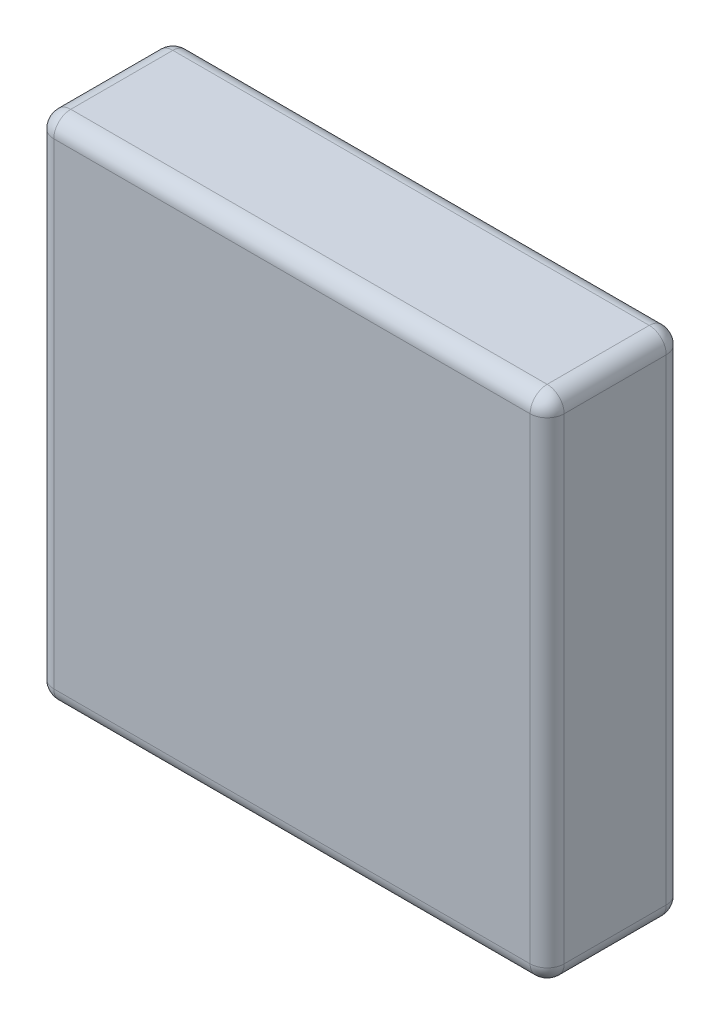
ISO-10303-21;
HEADER;
FILE_DESCRIPTION(('STEP AP214'),'2;1');
FILE_NAME('part.step','',(''),(''),'','','');
FILE_SCHEMA(('AUTOMOTIVE_DESIGN { 1 0 10303 214 1 1 1 1 }'));
ENDSEC;
DATA;
#1=APPLICATION_CONTEXT('core data for automotive mechanical design processes');
#2=APPLICATION_PROTOCOL_DEFINITION('international standard','automotive_design',2000,#1);
#3=PRODUCT_CONTEXT('',#1,'mechanical');
#4=PRODUCT('Part','Part','',(#3));
#5=PRODUCT_RELATED_PRODUCT_CATEGORY('part','',(#4));
#6=PRODUCT_DEFINITION_FORMATION('','',#4);
#7=PRODUCT_DEFINITION_CONTEXT('part definition',#1,'design');
#8=PRODUCT_DEFINITION('design','',#6,#7);
#9=PRODUCT_DEFINITION_SHAPE('','',#8);
#10=(LENGTH_UNIT() NAMED_UNIT(*) SI_UNIT(.MILLI.,.METRE.));
#11=(NAMED_UNIT(*) PLANE_ANGLE_UNIT() SI_UNIT($,.RADIAN.));
#12=(NAMED_UNIT(*) SI_UNIT($,.STERADIAN.) SOLID_ANGLE_UNIT());
#13=UNCERTAINTY_MEASURE_WITH_UNIT(LENGTH_MEASURE(1.E-05),#10,'distance_accuracy_value','');
#14=(GEOMETRIC_REPRESENTATION_CONTEXT(3) GLOBAL_UNCERTAINTY_ASSIGNED_CONTEXT((#13)) GLOBAL_UNIT_ASSIGNED_CONTEXT((#10,
#11,#12)) REPRESENTATION_CONTEXT('',''));
#15=CARTESIAN_POINT('',(0.,0.,0.));
#16=DIRECTION('',(0.,0.,1.));
#17=DIRECTION('',(1.,0.,0.));
#18=AXIS2_PLACEMENT_3D('',#15,#16,#17);
#19=CARTESIAN_POINT('',(0.,0.,8.));
#20=DIRECTION('',(1.,0.,0.));
#21=DIRECTION('',(0.,1.,0.));
#22=AXIS2_PLACEMENT_3D('',#19,#20,#21);
#23=PLANE('',#22);
#24=DIRECTION('',(0.,0.,-1.));
#25=VECTOR('',#24,1.);
#26=CARTESIAN_POINT('',(0.,-29.,8.));
#27=LINE('',#26,#25);
#28=CARTESIAN_POINT('',(0.,-29.,1.));
#29=VERTEX_POINT('',#28);
#30=CARTESIAN_POINT('',(0.,-29.,7.));
#31=VERTEX_POINT('',#30);
#32=EDGE_CURVE('E126',#29,#31,#27,.F.);
#33=ORIENTED_EDGE('',*,*,#32,.T.);
#34=DIRECTION('',(0.,-1.,0.));
#35=VECTOR('',#34,1.);
#36=CARTESIAN_POINT('',(0.,0.,7.));
#37=LINE('',#36,#35);
#38=CARTESIAN_POINT('',(0.,-1.,7.));
#39=VERTEX_POINT('',#38);
#40=EDGE_CURVE('E163',#31,#39,#37,.F.);
#41=ORIENTED_EDGE('',*,*,#40,.T.);
#42=DIRECTION('',(0.,0.,-1.));
#43=VECTOR('',#42,1.);
#44=CARTESIAN_POINT('',(0.,-1.,8.));
#45=LINE('',#44,#43);
#46=CARTESIAN_POINT('',(0.,-1.,1.));
#47=VERTEX_POINT('',#46);
#48=EDGE_CURVE('E160',#39,#47,#45,.T.);
#49=ORIENTED_EDGE('',*,*,#48,.T.);
#50=DIRECTION('',(0.,-1.,0.));
#51=VECTOR('',#50,1.);
#52=CARTESIAN_POINT('',(0.,0.,1.));
#53=LINE('',#52,#51);
#54=EDGE_CURVE('E155',#47,#29,#53,.T.);
#55=ORIENTED_EDGE('',*,*,#54,.T.);
#56=EDGE_LOOP('',(#33,#41,#49,#55));
#57=FACE_BOUND('',#56,.T.);
#58=ADVANCED_FACE('F31',(#57),#23,.F.);
#59=CARTESIAN_POINT('',(0.,-30.,8.));
#60=DIRECTION('',(0.,1.,0.));
#61=DIRECTION('',(0.,0.,1.));
#62=AXIS2_PLACEMENT_3D('',#59,#60,#61);
#63=PLANE('',#62);
#64=DIRECTION('',(0.,0.,-1.));
#65=VECTOR('',#64,1.);
#66=CARTESIAN_POINT('',(29.,-30.,8.));
#67=LINE('',#66,#65);
#68=CARTESIAN_POINT('',(29.,-30.,1.));
#69=VERTEX_POINT('',#68);
#70=CARTESIAN_POINT('',(29.,-30.,7.));
#71=VERTEX_POINT('',#70);
#72=EDGE_CURVE('E148',#69,#71,#67,.F.);
#73=ORIENTED_EDGE('',*,*,#72,.T.);
#74=DIRECTION('',(1.,0.,0.));
#75=VECTOR('',#74,1.);
#76=CARTESIAN_POINT('',(0.,-30.,7.));
#77=LINE('',#76,#75);
#78=CARTESIAN_POINT('',(1.,-30.,7.));
#79=VERTEX_POINT('',#78);
#80=EDGE_CURVE('E152',#71,#79,#77,.F.);
#81=ORIENTED_EDGE('',*,*,#80,.T.);
#82=DIRECTION('',(0.,0.,-1.));
#83=VECTOR('',#82,1.);
#84=CARTESIAN_POINT('',(1.,-30.,8.));
#85=LINE('',#84,#83);
#86=CARTESIAN_POINT('',(1.,-30.,1.));
#87=VERTEX_POINT('',#86);
#88=EDGE_CURVE('E124',#79,#87,#85,.T.);
#89=ORIENTED_EDGE('',*,*,#88,.T.);
#90=DIRECTION('',(1.,0.,0.));
#91=VECTOR('',#90,1.);
#92=CARTESIAN_POINT('',(0.,-30.,1.));
#93=LINE('',#92,#91);
#94=EDGE_CURVE('E142',#87,#69,#93,.T.);
#95=ORIENTED_EDGE('',*,*,#94,.T.);
#96=EDGE_LOOP('',(#73,#81,#89,#95));
#97=FACE_BOUND('',#96,.T.);
#98=ADVANCED_FACE('F150',(#97),#63,.F.);
#99=CARTESIAN_POINT('',(30.,0.,8.));
#100=DIRECTION('',(-1.,0.,0.));
#101=DIRECTION('',(0.,-1.,0.));
#102=AXIS2_PLACEMENT_3D('',#99,#100,#101);
#103=PLANE('',#102);
#104=DIRECTION('',(0.,0.,-1.));
#105=VECTOR('',#104,1.);
#106=CARTESIAN_POINT('',(30.,-1.,8.));
#107=LINE('',#106,#105);
#108=CARTESIAN_POINT('',(30.,-1.,1.));
#109=VERTEX_POINT('',#108);
#110=CARTESIAN_POINT('',(30.,-1.,7.));
#111=VERTEX_POINT('',#110);
#112=EDGE_CURVE('E167',#109,#111,#107,.F.);
#113=ORIENTED_EDGE('',*,*,#112,.T.);
#114=DIRECTION('',(0.,1.,0.));
#115=VECTOR('',#114,1.);
#116=CARTESIAN_POINT('',(30.,-30.,7.));
#117=LINE('',#116,#115);
#118=CARTESIAN_POINT('',(30.,-29.,7.));
#119=VERTEX_POINT('',#118);
#120=EDGE_CURVE('E172',#111,#119,#117,.F.);
#121=ORIENTED_EDGE('',*,*,#120,.T.);
#122=DIRECTION('',(0.,0.,-1.));
#123=VECTOR('',#122,1.);
#124=CARTESIAN_POINT('',(30.,-29.,8.));
#125=LINE('',#124,#123);
#126=CARTESIAN_POINT('',(30.,-29.,1.));
#127=VERTEX_POINT('',#126);
#128=EDGE_CURVE('E169',#119,#127,#125,.T.);
#129=ORIENTED_EDGE('',*,*,#128,.T.);
#130=DIRECTION('',(0.,1.,0.));
#131=VECTOR('',#130,1.);
#132=CARTESIAN_POINT('',(30.,0.,1.));
#133=LINE('',#132,#131);
#134=EDGE_CURVE('E165',#127,#109,#133,.T.);
#135=ORIENTED_EDGE('',*,*,#134,.T.);
#136=EDGE_LOOP('',(#113,#121,#129,#135));
#137=FACE_BOUND('',#136,.T.);
#138=ADVANCED_FACE('F277',(#137),#103,.F.);
#139=CARTESIAN_POINT('',(0.,0.,8.));
#140=DIRECTION('',(0.,-1.,0.));
#141=DIRECTION('',(0.,0.,-1.));
#142=AXIS2_PLACEMENT_3D('',#139,#140,#141);
#143=PLANE('',#142);
#144=DIRECTION('',(0.,0.,-1.));
#145=VECTOR('',#144,1.);
#146=CARTESIAN_POINT('',(1.,0.,8.));
#147=LINE('',#146,#145);
#148=CARTESIAN_POINT('',(1.,0.,1.));
#149=VERTEX_POINT('',#148);
#150=CARTESIAN_POINT('',(1.,0.,7.));
#151=VERTEX_POINT('',#150);
#152=EDGE_CURVE('E176',#149,#151,#147,.F.);
#153=ORIENTED_EDGE('',*,*,#152,.T.);
#154=DIRECTION('',(-1.,0.,0.));
#155=VECTOR('',#154,1.);
#156=CARTESIAN_POINT('',(30.,0.,7.));
#157=LINE('',#156,#155);
#158=CARTESIAN_POINT('',(29.,0.,7.));
#159=VERTEX_POINT('',#158);
#160=EDGE_CURVE('E181',#151,#159,#157,.F.);
#161=ORIENTED_EDGE('',*,*,#160,.T.);
#162=DIRECTION('',(0.,0.,-1.));
#163=VECTOR('',#162,1.);
#164=CARTESIAN_POINT('',(29.,0.,8.));
#165=LINE('',#164,#163);
#166=CARTESIAN_POINT('',(29.,0.,1.));
#167=VERTEX_POINT('',#166);
#168=EDGE_CURVE('E178',#159,#167,#165,.T.);
#169=ORIENTED_EDGE('',*,*,#168,.T.);
#170=DIRECTION('',(-1.,0.,0.));
#171=VECTOR('',#170,1.);
#172=CARTESIAN_POINT('',(0.,0.,1.));
#173=LINE('',#172,#171);
#174=EDGE_CURVE('E174',#167,#149,#173,.T.);
#175=ORIENTED_EDGE('',*,*,#174,.T.);
#176=EDGE_LOOP('',(#153,#161,#169,#175));
#177=FACE_BOUND('',#176,.T.);
#178=ADVANCED_FACE('F287',(#177),#143,.F.);
#179=CARTESIAN_POINT('',(0.,-30.,8.));
#180=DIRECTION('',(0.,0.,1.));
#181=DIRECTION('',(1.,0.,0.));
#182=AXIS2_PLACEMENT_3D('',#179,#180,#181);
#183=PLANE('',#182);
#184=DIRECTION('',(0.,1.,0.));
#185=VECTOR('',#184,1.);
#186=CARTESIAN_POINT('',(29.,0.,8.));
#187=LINE('',#186,#185);
#188=CARTESIAN_POINT('',(29.,-29.,8.));
#189=VERTEX_POINT('',#188);
#190=CARTESIAN_POINT('',(29.,-1.,8.));
#191=VERTEX_POINT('',#190);
#192=EDGE_CURVE('E187',#189,#191,#187,.T.);
#193=ORIENTED_EDGE('',*,*,#192,.T.);
#194=DIRECTION('',(-1.,0.,0.));
#195=VECTOR('',#194,1.);
#196=CARTESIAN_POINT('',(0.,-1.,8.));
#197=LINE('',#196,#195);
#198=CARTESIAN_POINT('',(1.,-1.,8.));
#199=VERTEX_POINT('',#198);
#200=EDGE_CURVE('E189',#191,#199,#197,.T.);
#201=ORIENTED_EDGE('',*,*,#200,.T.);
#202=DIRECTION('',(0.,-1.,0.));
#203=VECTOR('',#202,1.);
#204=CARTESIAN_POINT('',(1.,-30.,8.));
#205=LINE('',#204,#203);
#206=CARTESIAN_POINT('',(1.,-29.,8.));
#207=VERTEX_POINT('',#206);
#208=EDGE_CURVE('E183',#199,#207,#205,.T.);
#209=ORIENTED_EDGE('',*,*,#208,.T.);
#210=DIRECTION('',(1.,0.,0.));
#211=VECTOR('',#210,1.);
#212=CARTESIAN_POINT('',(30.,-29.,8.));
#213=LINE('',#212,#211);
#214=EDGE_CURVE('E185',#207,#189,#213,.T.);
#215=ORIENTED_EDGE('',*,*,#214,.T.);
#216=EDGE_LOOP('',(#193,#201,#209,#215));
#217=FACE_BOUND('',#216,.T.);
#218=ADVANCED_FACE('F269',(#217),#183,.T.);
#219=CARTESIAN_POINT('',(0.,-30.,0.));
#220=DIRECTION('',(0.,0.,1.));
#221=DIRECTION('',(1.,0.,0.));
#222=AXIS2_PLACEMENT_3D('',#219,#220,#221);
#223=PLANE('',#222);
#224=DIRECTION('',(0.,-1.,0.));
#225=VECTOR('',#224,1.);
#226=CARTESIAN_POINT('',(1.,-30.,0.));
#227=LINE('',#226,#225);
#228=CARTESIAN_POINT('',(1.,-29.,0.));
#229=VERTEX_POINT('',#228);
#230=CARTESIAN_POINT('',(1.,-1.,0.));
#231=VERTEX_POINT('',#230);
#232=EDGE_CURVE('E192',#229,#231,#227,.F.);
#233=ORIENTED_EDGE('',*,*,#232,.T.);
#234=DIRECTION('',(-1.,0.,0.));
#235=VECTOR('',#234,1.);
#236=CARTESIAN_POINT('',(0.,-1.,0.));
#237=LINE('',#236,#235);
#238=CARTESIAN_POINT('',(29.,-1.,0.));
#239=VERTEX_POINT('',#238);
#240=EDGE_CURVE('E11',#231,#239,#237,.F.);
#241=ORIENTED_EDGE('',*,*,#240,.T.);
#242=DIRECTION('',(0.,1.,0.));
#243=VECTOR('',#242,1.);
#244=CARTESIAN_POINT('',(29.,-30.,0.));
#245=LINE('',#244,#243);
#246=CARTESIAN_POINT('',(29.,-29.,0.));
#247=VERTEX_POINT('',#246);
#248=EDGE_CURVE('E40',#239,#247,#245,.F.);
#249=ORIENTED_EDGE('',*,*,#248,.T.);
#250=DIRECTION('',(1.,0.,0.));
#251=VECTOR('',#250,1.);
#252=CARTESIAN_POINT('',(0.,-29.,0.));
#253=LINE('',#252,#251);
#254=EDGE_CURVE('E194',#247,#229,#253,.F.);
#255=ORIENTED_EDGE('',*,*,#254,.T.);
#256=EDGE_LOOP('',(#233,#241,#249,#255));
#257=FACE_BOUND('',#256,.T.);
#258=ADVANCED_FACE('F476',(#257),#223,.F.);
#259=CARTESIAN_POINT('',(29.,-1.,8.));
#260=DIRECTION('',(0.,0.,-1.));
#261=DIRECTION('',(-1.,0.,0.));
#262=AXIS2_PLACEMENT_3D('',#259,#260,#261);
#263=CYLINDRICAL_SURFACE('',#262,1.);
#264=CARTESIAN_POINT('',(29.,-1.,7.));
#265=DIRECTION('',(0.,0.,1.));
#266=DIRECTION('',(1.,0.,0.));
#267=AXIS2_PLACEMENT_3D('',#264,#265,#266);
#268=CIRCLE('',#267,1.);
#269=EDGE_CURVE('E35',#111,#159,#268,.T.);
#270=ORIENTED_EDGE('',*,*,#269,.F.);
#271=ORIENTED_EDGE('',*,*,#112,.F.);
#272=CARTESIAN_POINT('',(29.,-1.,1.));
#273=DIRECTION('',(0.,0.,-1.));
#274=DIRECTION('',(-1.,0.,0.));
#275=AXIS2_PLACEMENT_3D('',#272,#273,#274);
#276=CIRCLE('',#275,1.);
#277=EDGE_CURVE('E247',#167,#109,#276,.T.);
#278=ORIENTED_EDGE('',*,*,#277,.F.);
#279=ORIENTED_EDGE('',*,*,#168,.F.);
#280=EDGE_LOOP('',(#270,#271,#278,#279));
#281=FACE_BOUND('',#280,.T.);
#282=ADVANCED_FACE('F33',(#281),#263,.T.);
#283=CARTESIAN_POINT('',(29.,-1.,7.));
#284=DIRECTION('',(0.,0.,1.));
#285=DIRECTION('',(1.,0.,0.));
#286=AXIS2_PLACEMENT_3D('',#283,#284,#285);
#287=SPHERICAL_SURFACE('',#286,1.);
#288=CARTESIAN_POINT('',(29.,-1.,7.));
#289=DIRECTION('',(0.,1.,0.));
#290=DIRECTION('',(-1.,0.,0.));
#291=AXIS2_PLACEMENT_3D('',#288,#289,#290);
#292=CIRCLE('',#291,1.);
#293=EDGE_CURVE('E242',#111,#191,#292,.F.);
#294=ORIENTED_EDGE('',*,*,#293,.F.);
#295=ORIENTED_EDGE('',*,*,#269,.T.);
#296=CARTESIAN_POINT('',(29.,-1.,7.));
#297=DIRECTION('',(1.,0.,0.));
#298=DIRECTION('',(0.,0.,-1.));
#299=AXIS2_PLACEMENT_3D('',#296,#297,#298);
#300=CIRCLE('',#299,1.);
#301=EDGE_CURVE('E245',#191,#159,#300,.F.);
#302=ORIENTED_EDGE('',*,*,#301,.F.);
#303=EDGE_LOOP('',(#294,#295,#302));
#304=FACE_BOUND('',#303,.T.);
#305=ADVANCED_FACE('F257',(#304),#287,.T.);
#306=CARTESIAN_POINT('',(29.,-1.,1.));
#307=DIRECTION('',(0.,0.,1.));
#308=DIRECTION('',(1.,0.,0.));
#309=AXIS2_PLACEMENT_3D('',#306,#307,#308);
#310=SPHERICAL_SURFACE('',#309,1.);
#311=CARTESIAN_POINT('',(29.,-1.,1.));
#312=DIRECTION('',(1.,0.,0.));
#313=DIRECTION('',(0.,0.,-1.));
#314=AXIS2_PLACEMENT_3D('',#311,#312,#313);
#315=CIRCLE('',#314,1.);
#316=EDGE_CURVE('E237',#167,#239,#315,.F.);
#317=ORIENTED_EDGE('',*,*,#316,.F.);
#318=ORIENTED_EDGE('',*,*,#277,.T.);
#319=CARTESIAN_POINT('',(29.,-1.,1.));
#320=DIRECTION('',(0.,1.,0.));
#321=DIRECTION('',(-1.,0.,0.));
#322=AXIS2_PLACEMENT_3D('',#319,#320,#321);
#323=CIRCLE('',#322,1.);
#324=EDGE_CURVE('E240',#239,#109,#323,.F.);
#325=ORIENTED_EDGE('',*,*,#324,.F.);
#326=EDGE_LOOP('',(#317,#318,#325));
#327=FACE_BOUND('',#326,.T.);
#328=ADVANCED_FACE('F455',(#327),#310,.T.);
#329=CARTESIAN_POINT('',(0.,-1.,7.));
#330=DIRECTION('',(1.,0.,0.));
#331=DIRECTION('',(0.,0.,-1.));
#332=AXIS2_PLACEMENT_3D('',#329,#330,#331);
#333=CYLINDRICAL_SURFACE('',#332,1.);
#334=ORIENTED_EDGE('',*,*,#301,.T.);
#335=ORIENTED_EDGE('',*,*,#160,.F.);
#336=CARTESIAN_POINT('',(1.,-1.,7.));
#337=DIRECTION('',(-1.,0.,0.));
#338=DIRECTION('',(0.,0.,1.));
#339=AXIS2_PLACEMENT_3D('',#336,#337,#338);
#340=CIRCLE('',#339,1.);
#341=EDGE_CURVE('E231',#199,#151,#340,.T.);
#342=ORIENTED_EDGE('',*,*,#341,.F.);
#343=ORIENTED_EDGE('',*,*,#200,.F.);
#344=EDGE_LOOP('',(#334,#335,#342,#343));
#345=FACE_BOUND('',#344,.T.);
#346=ADVANCED_FACE('F265',(#345),#333,.T.);
#347=CARTESIAN_POINT('',(29.,-30.,7.));
#348=DIRECTION('',(0.,-1.,0.));
#349=DIRECTION('',(1.,0.,0.));
#350=AXIS2_PLACEMENT_3D('',#347,#348,#349);
#351=CYLINDRICAL_SURFACE('',#350,1.);
#352=ORIENTED_EDGE('',*,*,#293,.T.);
#353=ORIENTED_EDGE('',*,*,#192,.F.);
#354=CARTESIAN_POINT('',(29.,-29.,7.));
#355=DIRECTION('',(0.,-1.,0.));
#356=DIRECTION('',(0.,0.,-1.));
#357=AXIS2_PLACEMENT_3D('',#354,#355,#356);
#358=CIRCLE('',#357,1.);
#359=EDGE_CURVE('E228',#119,#189,#358,.T.);
#360=ORIENTED_EDGE('',*,*,#359,.F.);
#361=ORIENTED_EDGE('',*,*,#120,.F.);
#362=EDGE_LOOP('',(#352,#353,#360,#361));
#363=FACE_BOUND('',#362,.T.);
#364=ADVANCED_FACE('F274',(#363),#351,.T.);
#365=CARTESIAN_POINT('',(29.,-29.,8.));
#366=DIRECTION('',(0.,0.,-1.));
#367=DIRECTION('',(-1.,0.,0.));
#368=AXIS2_PLACEMENT_3D('',#365,#366,#367);
#369=CYLINDRICAL_SURFACE('',#368,1.);
#370=CARTESIAN_POINT('',(29.,-29.,1.));
#371=DIRECTION('',(0.,0.,-1.));
#372=DIRECTION('',(-1.,0.,0.));
#373=AXIS2_PLACEMENT_3D('',#370,#371,#372);
#374=CIRCLE('',#373,1.);
#375=EDGE_CURVE('E222',#127,#69,#374,.T.);
#376=ORIENTED_EDGE('',*,*,#375,.F.);
#377=ORIENTED_EDGE('',*,*,#128,.F.);
#378=CARTESIAN_POINT('',(29.,-29.,7.));
#379=DIRECTION('',(0.,0.,1.));
#380=DIRECTION('',(1.,0.,0.));
#381=AXIS2_PLACEMENT_3D('',#378,#379,#380);
#382=CIRCLE('',#381,1.);
#383=EDGE_CURVE('E225',#71,#119,#382,.T.);
#384=ORIENTED_EDGE('',*,*,#383,.F.);
#385=ORIENTED_EDGE('',*,*,#72,.F.);
#386=EDGE_LOOP('',(#376,#377,#384,#385));
#387=FACE_BOUND('',#386,.T.);
#388=ADVANCED_FACE('F281',(#387),#369,.T.);
#389=CARTESIAN_POINT('',(29.,0.,1.));
#390=DIRECTION('',(0.,1.,0.));
#391=DIRECTION('',(-1.,0.,0.));
#392=AXIS2_PLACEMENT_3D('',#389,#390,#391);
#393=CYLINDRICAL_SURFACE('',#392,1.);
#394=ORIENTED_EDGE('',*,*,#324,.T.);
#395=ORIENTED_EDGE('',*,*,#134,.F.);
#396=CARTESIAN_POINT('',(29.,-29.,1.));
#397=DIRECTION('',(0.,-1.,0.));
#398=DIRECTION('',(0.,0.,-1.));
#399=AXIS2_PLACEMENT_3D('',#396,#397,#398);
#400=CIRCLE('',#399,1.);
#401=EDGE_CURVE('E220',#247,#127,#400,.T.);
#402=ORIENTED_EDGE('',*,*,#401,.F.);
#403=ORIENTED_EDGE('',*,*,#248,.F.);
#404=EDGE_LOOP('',(#394,#395,#402,#403));
#405=FACE_BOUND('',#404,.T.);
#406=ADVANCED_FACE('F285',(#405),#393,.T.);
#407=CARTESIAN_POINT('',(0.,-1.,1.));
#408=DIRECTION('',(-1.,0.,0.));
#409=DIRECTION('',(0.,0.,1.));
#410=AXIS2_PLACEMENT_3D('',#407,#408,#409);
#411=CYLINDRICAL_SURFACE('',#410,1.);
#412=ORIENTED_EDGE('',*,*,#316,.T.);
#413=ORIENTED_EDGE('',*,*,#240,.F.);
#414=CARTESIAN_POINT('',(1.,-1.,1.));
#415=DIRECTION('',(-1.,0.,0.));
#416=DIRECTION('',(0.,0.,1.));
#417=AXIS2_PLACEMENT_3D('',#414,#415,#416);
#418=CIRCLE('',#417,1.);
#419=EDGE_CURVE('E217',#149,#231,#418,.T.);
#420=ORIENTED_EDGE('',*,*,#419,.F.);
#421=ORIENTED_EDGE('',*,*,#174,.F.);
#422=EDGE_LOOP('',(#412,#413,#420,#421));
#423=FACE_BOUND('',#422,.T.);
#424=ADVANCED_FACE('F297',(#423),#411,.T.);
#425=CARTESIAN_POINT('',(1.,-1.,8.));
#426=DIRECTION('',(0.,0.,-1.));
#427=DIRECTION('',(-1.,0.,0.));
#428=AXIS2_PLACEMENT_3D('',#425,#426,#427);
#429=CYLINDRICAL_SURFACE('',#428,1.);
#430=CARTESIAN_POINT('',(1.,-1.,7.));
#431=DIRECTION('',(0.,0.,1.));
#432=DIRECTION('',(1.,0.,0.));
#433=AXIS2_PLACEMENT_3D('',#430,#431,#432);
#434=CIRCLE('',#433,1.);
#435=EDGE_CURVE('E234',#151,#39,#434,.T.);
#436=ORIENTED_EDGE('',*,*,#435,.F.);
#437=ORIENTED_EDGE('',*,*,#152,.F.);
#438=CARTESIAN_POINT('',(1.,-1.,1.));
#439=DIRECTION('',(0.,0.,-1.));
#440=DIRECTION('',(-1.,0.,0.));
#441=AXIS2_PLACEMENT_3D('',#438,#439,#440);
#442=CIRCLE('',#441,1.);
#443=EDGE_CURVE('E214',#47,#149,#442,.T.);
#444=ORIENTED_EDGE('',*,*,#443,.F.);
#445=ORIENTED_EDGE('',*,*,#48,.F.);
#446=EDGE_LOOP('',(#436,#437,#444,#445));
#447=FACE_BOUND('',#446,.T.);
#448=ADVANCED_FACE('F292',(#447),#429,.T.);
#449=CARTESIAN_POINT('',(1.,-1.,7.));
#450=DIRECTION('',(0.,0.,1.));
#451=DIRECTION('',(1.,0.,0.));
#452=AXIS2_PLACEMENT_3D('',#449,#450,#451);
#453=SPHERICAL_SURFACE('',#452,1.);
#454=ORIENTED_EDGE('',*,*,#341,.T.);
#455=ORIENTED_EDGE('',*,*,#435,.T.);
#456=CARTESIAN_POINT('',(1.,-1.,7.));
#457=DIRECTION('',(0.,1.,0.));
#458=DIRECTION('',(0.,0.,1.));
#459=AXIS2_PLACEMENT_3D('',#456,#457,#458);
#460=CIRCLE('',#459,1.);
#461=EDGE_CURVE('E211',#199,#39,#460,.F.);
#462=ORIENTED_EDGE('',*,*,#461,.F.);
#463=EDGE_LOOP('',(#454,#455,#462));
#464=FACE_BOUND('',#463,.T.);
#465=ADVANCED_FACE('F308',(#464),#453,.T.);
#466=CARTESIAN_POINT('',(29.,-29.,7.));
#467=DIRECTION('',(0.,0.,1.));
#468=DIRECTION('',(1.,0.,0.));
#469=AXIS2_PLACEMENT_3D('',#466,#467,#468);
#470=SPHERICAL_SURFACE('',#469,1.);
#471=ORIENTED_EDGE('',*,*,#383,.T.);
#472=ORIENTED_EDGE('',*,*,#359,.T.);
#473=CARTESIAN_POINT('',(29.,-29.,7.));
#474=DIRECTION('',(1.,0.,0.));
#475=DIRECTION('',(0.,0.,-1.));
#476=AXIS2_PLACEMENT_3D('',#473,#474,#475);
#477=CIRCLE('',#476,1.);
#478=EDGE_CURVE('E208',#71,#189,#477,.F.);
#479=ORIENTED_EDGE('',*,*,#478,.F.);
#480=EDGE_LOOP('',(#471,#472,#479));
#481=FACE_BOUND('',#480,.T.);
#482=ADVANCED_FACE('F318',(#481),#470,.T.);
#483=CARTESIAN_POINT('',(29.,-29.,1.));
#484=DIRECTION('',(0.,0.,1.));
#485=DIRECTION('',(1.,0.,0.));
#486=AXIS2_PLACEMENT_3D('',#483,#484,#485);
#487=SPHERICAL_SURFACE('',#486,1.);
#488=ORIENTED_EDGE('',*,*,#401,.T.);
#489=ORIENTED_EDGE('',*,*,#375,.T.);
#490=CARTESIAN_POINT('',(29.,-29.,1.));
#491=DIRECTION('',(1.,0.,0.));
#492=DIRECTION('',(0.,0.,-1.));
#493=AXIS2_PLACEMENT_3D('',#490,#491,#492);
#494=CIRCLE('',#493,1.);
#495=EDGE_CURVE('E145',#247,#69,#494,.F.);
#496=ORIENTED_EDGE('',*,*,#495,.F.);
#497=EDGE_LOOP('',(#488,#489,#496));
#498=FACE_BOUND('',#497,.T.);
#499=ADVANCED_FACE('F320',(#498),#487,.T.);
#500=CARTESIAN_POINT('',(1.,-1.,1.));
#501=DIRECTION('',(0.,0.,1.));
#502=DIRECTION('',(1.,0.,0.));
#503=AXIS2_PLACEMENT_3D('',#500,#501,#502);
#504=SPHERICAL_SURFACE('',#503,1.);
#505=ORIENTED_EDGE('',*,*,#443,.T.);
#506=ORIENTED_EDGE('',*,*,#419,.T.);
#507=CARTESIAN_POINT('',(1.,-1.,1.));
#508=DIRECTION('',(0.,1.,0.));
#509=DIRECTION('',(-1.,0.,0.));
#510=AXIS2_PLACEMENT_3D('',#507,#508,#509);
#511=CIRCLE('',#510,1.);
#512=EDGE_CURVE('E204',#47,#231,#511,.F.);
#513=ORIENTED_EDGE('',*,*,#512,.F.);
#514=EDGE_LOOP('',(#505,#506,#513));
#515=FACE_BOUND('',#514,.T.);
#516=ADVANCED_FACE('F299',(#515),#504,.T.);
#517=CARTESIAN_POINT('',(1.,-30.,7.));
#518=DIRECTION('',(0.,1.,0.));
#519=DIRECTION('',(-1.,0.,0.));
#520=AXIS2_PLACEMENT_3D('',#517,#518,#519);
#521=CYLINDRICAL_SURFACE('',#520,1.);
#522=ORIENTED_EDGE('',*,*,#461,.T.);
#523=ORIENTED_EDGE('',*,*,#40,.F.);
#524=CARTESIAN_POINT('',(1.,-29.,7.));
#525=DIRECTION('',(0.,-1.,0.));
#526=DIRECTION('',(0.,0.,-1.));
#527=AXIS2_PLACEMENT_3D('',#524,#525,#526);
#528=CIRCLE('',#527,1.);
#529=EDGE_CURVE('E201',#207,#31,#528,.T.);
#530=ORIENTED_EDGE('',*,*,#529,.F.);
#531=ORIENTED_EDGE('',*,*,#208,.F.);
#532=EDGE_LOOP('',(#522,#523,#530,#531));
#533=FACE_BOUND('',#532,.T.);
#534=ADVANCED_FACE('F310',(#533),#521,.T.);
#535=CARTESIAN_POINT('',(0.,-29.,7.));
#536=DIRECTION('',(-1.,0.,0.));
#537=DIRECTION('',(0.,0.,1.));
#538=AXIS2_PLACEMENT_3D('',#535,#536,#537);
#539=CYLINDRICAL_SURFACE('',#538,1.);
#540=ORIENTED_EDGE('',*,*,#478,.T.);
#541=ORIENTED_EDGE('',*,*,#214,.F.);
#542=CARTESIAN_POINT('',(1.,-29.,7.));
#543=DIRECTION('',(-1.,0.,0.));
#544=DIRECTION('',(0.,0.,1.));
#545=AXIS2_PLACEMENT_3D('',#542,#543,#544);
#546=CIRCLE('',#545,1.);
#547=EDGE_CURVE('E139',#79,#207,#546,.T.);
#548=ORIENTED_EDGE('',*,*,#547,.F.);
#549=ORIENTED_EDGE('',*,*,#80,.F.);
#550=EDGE_LOOP('',(#540,#541,#548,#549));
#551=FACE_BOUND('',#550,.T.);
#552=ADVANCED_FACE('F316',(#551),#539,.T.);
#553=CARTESIAN_POINT('',(0.,-29.,1.));
#554=DIRECTION('',(1.,0.,0.));
#555=DIRECTION('',(0.,0.,-1.));
#556=AXIS2_PLACEMENT_3D('',#553,#554,#555);
#557=CYLINDRICAL_SURFACE('',#556,1.);
#558=ORIENTED_EDGE('',*,*,#495,.T.);
#559=ORIENTED_EDGE('',*,*,#94,.F.);
#560=CARTESIAN_POINT('',(1.,-29.,1.));
#561=DIRECTION('',(-1.,0.,0.));
#562=DIRECTION('',(0.,0.,1.));
#563=AXIS2_PLACEMENT_3D('',#560,#561,#562);
#564=CIRCLE('',#563,1.);
#565=EDGE_CURVE('E132',#229,#87,#564,.T.);
#566=ORIENTED_EDGE('',*,*,#565,.F.);
#567=ORIENTED_EDGE('',*,*,#254,.F.);
#568=EDGE_LOOP('',(#558,#559,#566,#567));
#569=FACE_BOUND('',#568,.T.);
#570=ADVANCED_FACE('F143',(#569),#557,.T.);
#571=CARTESIAN_POINT('',(1.,0.,1.));
#572=DIRECTION('',(0.,-1.,0.));
#573=DIRECTION('',(1.,0.,0.));
#574=AXIS2_PLACEMENT_3D('',#571,#572,#573);
#575=CYLINDRICAL_SURFACE('',#574,1.);
#576=ORIENTED_EDGE('',*,*,#512,.T.);
#577=ORIENTED_EDGE('',*,*,#232,.F.);
#578=CARTESIAN_POINT('',(1.,-29.,1.));
#579=DIRECTION('',(0.,-1.,0.));
#580=DIRECTION('',(0.,0.,-1.));
#581=AXIS2_PLACEMENT_3D('',#578,#579,#580);
#582=CIRCLE('',#581,1.);
#583=EDGE_CURVE('E136',#29,#229,#582,.T.);
#584=ORIENTED_EDGE('',*,*,#583,.F.);
#585=ORIENTED_EDGE('',*,*,#54,.F.);
#586=EDGE_LOOP('',(#576,#577,#584,#585));
#587=FACE_BOUND('',#586,.T.);
#588=ADVANCED_FACE('F303',(#587),#575,.T.);
#589=CARTESIAN_POINT('',(1.,-29.,7.));
#590=DIRECTION('',(0.,0.,1.));
#591=DIRECTION('',(1.,0.,0.));
#592=AXIS2_PLACEMENT_3D('',#589,#590,#591);
#593=SPHERICAL_SURFACE('',#592,1.);
#594=ORIENTED_EDGE('',*,*,#547,.T.);
#595=ORIENTED_EDGE('',*,*,#529,.T.);
#596=CARTESIAN_POINT('',(1.,-29.,7.));
#597=DIRECTION('',(0.,0.,1.));
#598=DIRECTION('',(1.,0.,0.));
#599=AXIS2_PLACEMENT_3D('',#596,#597,#598);
#600=CIRCLE('',#599,1.);
#601=EDGE_CURVE('E129',#79,#31,#600,.F.);
#602=ORIENTED_EDGE('',*,*,#601,.F.);
#603=EDGE_LOOP('',(#594,#595,#602));
#604=FACE_BOUND('',#603,.T.);
#605=ADVANCED_FACE('F314',(#604),#593,.T.);
#606=CARTESIAN_POINT('',(1.,-29.,1.));
#607=DIRECTION('',(0.,0.,1.));
#608=DIRECTION('',(1.,0.,0.));
#609=AXIS2_PLACEMENT_3D('',#606,#607,#608);
#610=SPHERICAL_SURFACE('',#609,1.);
#611=ORIENTED_EDGE('',*,*,#583,.T.);
#612=ORIENTED_EDGE('',*,*,#565,.T.);
#613=CARTESIAN_POINT('',(1.,-29.,1.));
#614=DIRECTION('',(0.,0.,-1.));
#615=DIRECTION('',(-1.,0.,0.));
#616=AXIS2_PLACEMENT_3D('',#613,#614,#615);
#617=CIRCLE('',#616,1.);
#618=EDGE_CURVE('E120',#29,#87,#617,.F.);
#619=ORIENTED_EDGE('',*,*,#618,.F.);
#620=EDGE_LOOP('',(#611,#612,#619));
#621=FACE_BOUND('',#620,.T.);
#622=ADVANCED_FACE('F134',(#621),#610,.T.);
#623=CARTESIAN_POINT('',(1.,-29.,8.));
#624=DIRECTION('',(0.,0.,-1.));
#625=DIRECTION('',(-1.,0.,0.));
#626=AXIS2_PLACEMENT_3D('',#623,#624,#625);
#627=CYLINDRICAL_SURFACE('',#626,1.);
#628=ORIENTED_EDGE('',*,*,#601,.T.);
#629=ORIENTED_EDGE('',*,*,#32,.F.);
#630=ORIENTED_EDGE('',*,*,#618,.T.);
#631=ORIENTED_EDGE('',*,*,#88,.F.);
#632=EDGE_LOOP('',(#628,#629,#630,#631));
#633=FACE_BOUND('',#632,.T.);
#634=ADVANCED_FACE('F122',(#633),#627,.T.);
#635=CLOSED_SHELL('',(#58,#98,#138,#178,#218,#258,#282,#305,#328,#346,#364,#388,#406,#424,#448,
#465,#482,#499,#516,#534,#552,#570,#588,#605,#622,#634));
#636=MANIFOLD_SOLID_BREP('B2',#635);
#637=ADVANCED_BREP_SHAPE_REPRESENTATION('',(#18,#636),#14);
#638=SHAPE_DEFINITION_REPRESENTATION(#9,#637);
ENDSEC;
END-ISO-10303-21;
